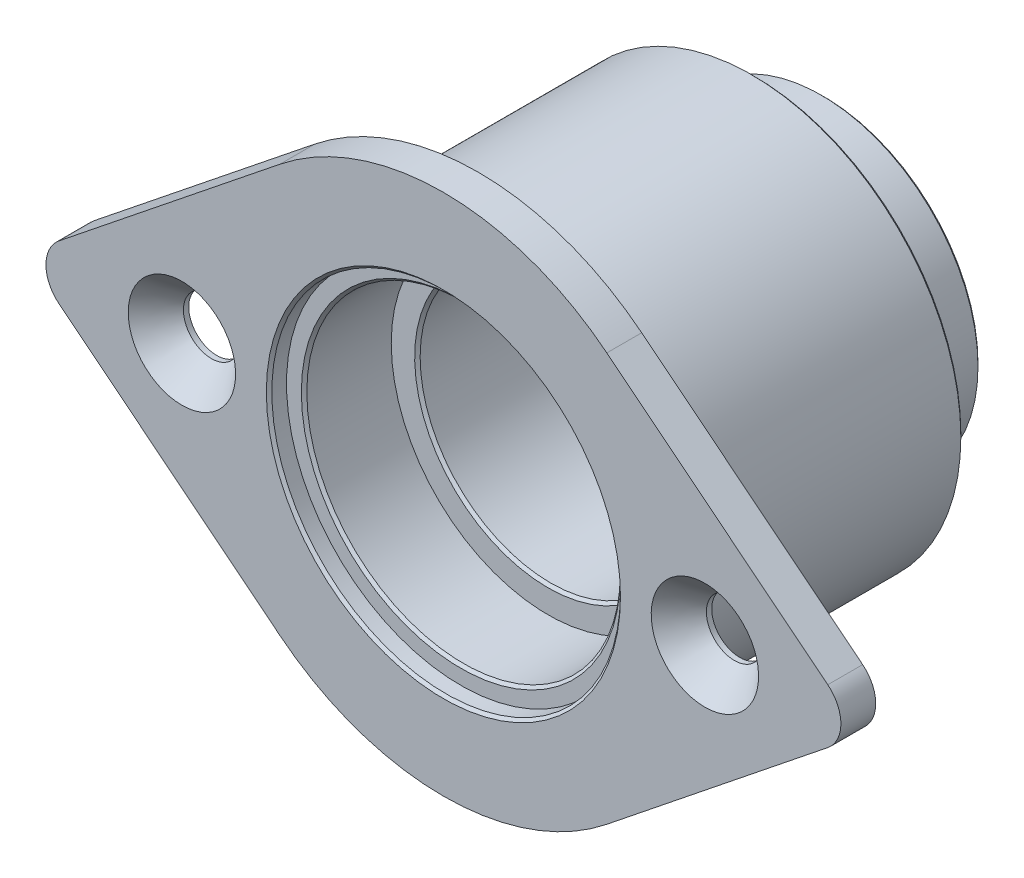
ISO-10303-21;
HEADER;
FILE_DESCRIPTION(('STEP AP214'),'2;1');
FILE_NAME('part.step','',(''),(''),'','','');
FILE_SCHEMA(('AUTOMOTIVE_DESIGN { 1 0 10303 214 1 1 1 1 }'));
ENDSEC;
DATA;
#1=APPLICATION_CONTEXT('core data for automotive mechanical design processes');
#2=APPLICATION_PROTOCOL_DEFINITION('international standard','automotive_design',2000,#1);
#3=PRODUCT_CONTEXT('',#1,'mechanical');
#4=PRODUCT('Part','Part','',(#3));
#5=PRODUCT_RELATED_PRODUCT_CATEGORY('part','',(#4));
#6=PRODUCT_DEFINITION_FORMATION('','',#4);
#7=PRODUCT_DEFINITION_CONTEXT('part definition',#1,'design');
#8=PRODUCT_DEFINITION('design','',#6,#7);
#9=PRODUCT_DEFINITION_SHAPE('','',#8);
#10=(LENGTH_UNIT() NAMED_UNIT(*) SI_UNIT(.MILLI.,.METRE.));
#11=(NAMED_UNIT(*) PLANE_ANGLE_UNIT() SI_UNIT($,.RADIAN.));
#12=(NAMED_UNIT(*) SI_UNIT($,.STERADIAN.) SOLID_ANGLE_UNIT());
#13=UNCERTAINTY_MEASURE_WITH_UNIT(LENGTH_MEASURE(1.E-05),#10,'distance_accuracy_value','');
#14=(GEOMETRIC_REPRESENTATION_CONTEXT(3) GLOBAL_UNCERTAINTY_ASSIGNED_CONTEXT((#13)) GLOBAL_UNIT_ASSIGNED_CONTEXT((#10,
#11,#12)) REPRESENTATION_CONTEXT('',''));
#15=CARTESIAN_POINT('',(0.,0.,0.));
#16=DIRECTION('',(0.,0.,1.));
#17=DIRECTION('',(1.,0.,0.));
#18=AXIS2_PLACEMENT_3D('',#15,#16,#17);
#19=CARTESIAN_POINT('',(0.,0.,-7.9375));
#20=DIRECTION('',(0.,0.,1.));
#21=DIRECTION('',(1.,0.,0.));
#22=AXIS2_PLACEMENT_3D('',#19,#20,#21);
#23=PLANE('',#22);
#24=CARTESIAN_POINT('',(0.,0.,-7.9375));
#25=DIRECTION('',(0.,0.,-1.));
#26=DIRECTION('',(-1.,0.,0.));
#27=AXIS2_PLACEMENT_3D('',#24,#25,#26);
#28=CIRCLE('',#27,14.2748);
#29=CARTESIAN_POINT('',(-14.2748,0.,-7.9375));
#30=VERTEX_POINT('',#29);
#31=EDGE_CURVE('E136',#30,#30,#28,.F.);
#32=ORIENTED_EDGE('',*,*,#31,.T.);
#33=EDGE_LOOP('',(#32));
#34=FACE_BOUND('',#33,.T.);
#35=CARTESIAN_POINT('',(0.,0.,-7.9375));
#36=DIRECTION('',(0.,0.,1.));
#37=DIRECTION('',(0.,-1.,0.));
#38=AXIS2_PLACEMENT_3D('',#35,#36,#37);
#39=CIRCLE('',#38,12.1435499999999);
#40=CARTESIAN_POINT('',(0.,-12.1435499999999,-7.9375));
#41=VERTEX_POINT('',#40);
#42=EDGE_CURVE('E20',#41,#41,#39,.F.);
#43=ORIENTED_EDGE('',*,*,#42,.T.);
#44=EDGE_LOOP('',(#43));
#45=FACE_BOUND('',#44,.T.);
#46=ADVANCED_FACE('F17',(#34,#45),#23,.T.);
#47=CARTESIAN_POINT('',(0.,0.,-7.9375));
#48=DIRECTION('',(0.,0.,1.));
#49=DIRECTION('',(0.,-1.,0.));
#50=AXIS2_PLACEMENT_3D('',#47,#48,#49);
#51=CONICAL_SURFACE('',#50,12.1435499999999,0.785398163397434);
#52=CARTESIAN_POINT('',(0.,0.,-8.18749999999995));
#53=DIRECTION('',(0.,0.,-1.));
#54=DIRECTION('',(-1.,0.,0.));
#55=AXIS2_PLACEMENT_3D('',#52,#53,#54);
#56=CIRCLE('',#55,11.89355);
#57=CARTESIAN_POINT('',(-11.89355,0.,-8.18749999999995));
#58=VERTEX_POINT('',#57);
#59=EDGE_CURVE('E134',#58,#58,#56,.T.);
#60=ORIENTED_EDGE('',*,*,#59,.T.);
#61=EDGE_LOOP('',(#60));
#62=FACE_BOUND('',#61,.T.);
#63=ORIENTED_EDGE('',*,*,#42,.F.);
#64=EDGE_LOOP('',(#63));
#65=FACE_BOUND('',#64,.T.);
#66=ADVANCED_FACE('F195',(#62,#65),#51,.F.);
#67=CARTESIAN_POINT('',(0.,0.,1.5875));
#68=DIRECTION('',(0.,0.,-1.));
#69=DIRECTION('',(-1.,0.,0.));
#70=AXIS2_PLACEMENT_3D('',#67,#68,#69);
#71=CYLINDRICAL_SURFACE('',#70,14.2748);
#72=CARTESIAN_POINT('',(0.,0.,-0.249999999999985));
#73=DIRECTION('',(0.,0.,1.));
#74=DIRECTION('',(1.,0.,0.));
#75=AXIS2_PLACEMENT_3D('',#72,#73,#74);
#76=CIRCLE('',#75,14.2748);
#77=CARTESIAN_POINT('',(14.2748,0.,-0.249999999999985));
#78=VERTEX_POINT('',#77);
#79=EDGE_CURVE('E131',#78,#78,#76,.T.);
#80=ORIENTED_EDGE('',*,*,#79,.T.);
#81=EDGE_LOOP('',(#80));
#82=FACE_BOUND('',#81,.T.);
#83=ORIENTED_EDGE('',*,*,#31,.F.);
#84=EDGE_LOOP('',(#83));
#85=FACE_BOUND('',#84,.T.);
#86=ADVANCED_FACE('F197',(#82,#85),#71,.F.);
#87=CARTESIAN_POINT('',(0.,0.,38.7877315203269));
#88=DIRECTION('',(0.,0.,-1.));
#89=DIRECTION('',(-1.,0.,0.));
#90=AXIS2_PLACEMENT_3D('',#87,#88,#89);
#91=CYLINDRICAL_SURFACE('',#90,11.89355);
#92=ORIENTED_EDGE('',*,*,#59,.F.);
#93=EDGE_LOOP('',(#92));
#94=FACE_BOUND('',#93,.T.);
#95=CARTESIAN_POINT('',(0.,0.,-32.8334999999999));
#96=DIRECTION('',(0.,0.,-1.));
#97=DIRECTION('',(-1.,0.,0.));
#98=AXIS2_PLACEMENT_3D('',#95,#96,#97);
#99=CIRCLE('',#98,11.89355);
#100=CARTESIAN_POINT('',(-11.89355,0.,-32.8334999999999));
#101=VERTEX_POINT('',#100);
#102=EDGE_CURVE('E127',#101,#101,#99,.T.);
#103=ORIENTED_EDGE('',*,*,#102,.T.);
#104=EDGE_LOOP('',(#103));
#105=FACE_BOUND('',#104,.T.);
#106=ADVANCED_FACE('F204',(#94,#105),#91,.F.);
#107=CARTESIAN_POINT('',(0.,0.,0.));
#108=DIRECTION('',(0.,0.,1.));
#109=DIRECTION('',(1.,0.,0.));
#110=AXIS2_PLACEMENT_3D('',#107,#108,#109);
#111=CONICAL_SURFACE('',#110,14.5248,0.785398163397459);
#112=ORIENTED_EDGE('',*,*,#79,.F.);
#113=EDGE_LOOP('',(#112));
#114=FACE_BOUND('',#113,.T.);
#115=CARTESIAN_POINT('',(0.,0.,0.));
#116=DIRECTION('',(0.,0.,1.));
#117=DIRECTION('',(1.,0.,0.));
#118=AXIS2_PLACEMENT_3D('',#115,#116,#117);
#119=CIRCLE('',#118,14.5248);
#120=CARTESIAN_POINT('',(14.5248,0.,0.));
#121=VERTEX_POINT('',#120);
#122=EDGE_CURVE('E130',#121,#121,#119,.F.);
#123=ORIENTED_EDGE('',*,*,#122,.F.);
#124=EDGE_LOOP('',(#123));
#125=FACE_BOUND('',#124,.T.);
#126=ADVANCED_FACE('F300',(#114,#125),#111,.F.);
#127=CARTESIAN_POINT('',(0.,0.,-33.0835));
#128=DIRECTION('',(0.,0.,-1.));
#129=DIRECTION('',(0.,1.,0.));
#130=AXIS2_PLACEMENT_3D('',#127,#128,#129);
#131=CONICAL_SURFACE('',#130,12.1435500000001,0.785398163397448);
#132=ORIENTED_EDGE('',*,*,#102,.F.);
#133=EDGE_LOOP('',(#132));
#134=FACE_BOUND('',#133,.T.);
#135=CARTESIAN_POINT('',(0.,0.,-33.0835));
#136=DIRECTION('',(0.,0.,-1.));
#137=DIRECTION('',(0.,1.,0.));
#138=AXIS2_PLACEMENT_3D('',#135,#136,#137);
#139=CIRCLE('',#138,12.1435500000001);
#140=CARTESIAN_POINT('',(0.,12.1435500000001,-33.0835));
#141=VERTEX_POINT('',#140);
#142=EDGE_CURVE('E184',#141,#141,#139,.F.);
#143=ORIENTED_EDGE('',*,*,#142,.F.);
#144=EDGE_LOOP('',(#143));
#145=FACE_BOUND('',#144,.T.);
#146=ADVANCED_FACE('F296',(#134,#145),#131,.F.);
#147=CARTESIAN_POINT('',(0.,0.,0.));
#148=DIRECTION('',(0.,0.,1.));
#149=DIRECTION('',(1.,0.,0.));
#150=AXIS2_PLACEMENT_3D('',#147,#148,#149);
#151=PLANE('',#150);
#152=CARTESIAN_POINT('',(0.,0.,0.));
#153=DIRECTION('',(0.,0.,1.));
#154=DIRECTION('',(1.,0.,0.));
#155=AXIS2_PLACEMENT_3D('',#152,#153,#154);
#156=CIRCLE('',#155,15.875);
#157=CARTESIAN_POINT('',(15.875,0.,0.));
#158=VERTEX_POINT('',#157);
#159=EDGE_CURVE('E181',#158,#158,#156,.T.);
#160=ORIENTED_EDGE('',*,*,#159,.T.);
#161=EDGE_LOOP('',(#160));
#162=FACE_BOUND('',#161,.T.);
#163=ORIENTED_EDGE('',*,*,#122,.T.);
#164=EDGE_LOOP('',(#163));
#165=FACE_BOUND('',#164,.T.);
#166=ADVANCED_FACE('F292',(#162,#165),#151,.T.);
#167=CARTESIAN_POINT('',(0.,0.,-33.0835));
#168=DIRECTION('',(0.,0.,-1.));
#169=DIRECTION('',(-1.,0.,0.));
#170=AXIS2_PLACEMENT_3D('',#167,#168,#169);
#171=PLANE('',#170);
#172=ORIENTED_EDGE('',*,*,#142,.T.);
#173=EDGE_LOOP('',(#172));
#174=FACE_BOUND('',#173,.T.);
#175=CARTESIAN_POINT('',(0.,0.,-33.0835));
#176=DIRECTION('',(0.,0.,1.));
#177=DIRECTION('',(1.,0.,0.));
#178=AXIS2_PLACEMENT_3D('',#175,#176,#177);
#179=CIRCLE('',#178,14.0121);
#180=CARTESIAN_POINT('',(14.0121,0.,-33.0835));
#181=VERTEX_POINT('',#180);
#182=EDGE_CURVE('E126',#181,#181,#179,.T.);
#183=ORIENTED_EDGE('',*,*,#182,.F.);
#184=EDGE_LOOP('',(#183));
#185=FACE_BOUND('',#184,.T.);
#186=ADVANCED_FACE('F288',(#174,#185),#171,.T.);
#187=CARTESIAN_POINT('',(0.,0.,0.));
#188=DIRECTION('',(0.,0.,1.));
#189=DIRECTION('',(1.,0.,0.));
#190=AXIS2_PLACEMENT_3D('',#187,#188,#189);
#191=CYLINDRICAL_SURFACE('',#190,15.875);
#192=ORIENTED_EDGE('',*,*,#159,.F.);
#193=EDGE_LOOP('',(#192));
#194=FACE_BOUND('',#193,.T.);
#195=CARTESIAN_POINT('',(0.,0.,1.3375));
#196=DIRECTION('',(0.,0.,1.));
#197=DIRECTION('',(1.,0.,0.));
#198=AXIS2_PLACEMENT_3D('',#195,#196,#197);
#199=CIRCLE('',#198,15.875);
#200=CARTESIAN_POINT('',(15.875,0.,1.3375));
#201=VERTEX_POINT('',#200);
#202=EDGE_CURVE('E123',#201,#201,#199,.T.);
#203=ORIENTED_EDGE('',*,*,#202,.T.);
#204=EDGE_LOOP('',(#203));
#205=FACE_BOUND('',#204,.T.);
#206=ADVANCED_FACE('F284',(#194,#205),#191,.F.);
#207=CARTESIAN_POINT('',(0.,0.,-32.8335));
#208=DIRECTION('',(0.,0.,1.));
#209=DIRECTION('',(1.,0.,0.));
#210=AXIS2_PLACEMENT_3D('',#207,#208,#209);
#211=CONICAL_SURFACE('',#210,14.2621,0.785398163397424);
#212=CARTESIAN_POINT('',(0.,0.,-32.8335));
#213=DIRECTION('',(0.,0.,-1.));
#214=DIRECTION('',(-1.,0.,0.));
#215=AXIS2_PLACEMENT_3D('',#212,#213,#214);
#216=CIRCLE('',#215,14.2621);
#217=CARTESIAN_POINT('',(-14.2621,0.,-32.8335));
#218=VERTEX_POINT('',#217);
#219=EDGE_CURVE('E119',#218,#218,#216,.F.);
#220=ORIENTED_EDGE('',*,*,#219,.F.);
#221=EDGE_LOOP('',(#220));
#222=FACE_BOUND('',#221,.T.);
#223=ORIENTED_EDGE('',*,*,#182,.T.);
#224=EDGE_LOOP('',(#223));
#225=FACE_BOUND('',#224,.T.);
#226=ADVANCED_FACE('F280',(#222,#225),#211,.T.);
#227=CARTESIAN_POINT('',(0.,0.,1.5875));
#228=DIRECTION('',(0.,0.,1.));
#229=DIRECTION('',(1.,0.,0.));
#230=AXIS2_PLACEMENT_3D('',#227,#228,#229);
#231=CONICAL_SURFACE('',#230,16.125,0.785398163397476);
#232=ORIENTED_EDGE('',*,*,#202,.F.);
#233=EDGE_LOOP('',(#232));
#234=FACE_BOUND('',#233,.T.);
#235=CARTESIAN_POINT('',(0.,0.,1.5875));
#236=DIRECTION('',(0.,0.,1.));
#237=DIRECTION('',(1.,0.,0.));
#238=AXIS2_PLACEMENT_3D('',#235,#236,#237);
#239=CIRCLE('',#238,16.125);
#240=CARTESIAN_POINT('',(16.125,0.,1.5875));
#241=VERTEX_POINT('',#240);
#242=EDGE_CURVE('E122',#241,#241,#239,.F.);
#243=ORIENTED_EDGE('',*,*,#242,.F.);
#244=EDGE_LOOP('',(#243));
#245=FACE_BOUND('',#244,.T.);
#246=ADVANCED_FACE('F276',(#234,#245),#231,.F.);
#247=CARTESIAN_POINT('',(0.,0.,27.1480367264149));
#248=DIRECTION('',(0.,0.,-1.));
#249=DIRECTION('',(-1.,0.,0.));
#250=AXIS2_PLACEMENT_3D('',#247,#248,#249);
#251=CYLINDRICAL_SURFACE('',#250,14.2621);
#252=ORIENTED_EDGE('',*,*,#219,.T.);
#253=EDGE_LOOP('',(#252));
#254=FACE_BOUND('',#253,.T.);
#255=CARTESIAN_POINT('',(0.,0.,-26.7335));
#256=DIRECTION('',(0.,0.,-1.));
#257=DIRECTION('',(-1.,0.,0.));
#258=AXIS2_PLACEMENT_3D('',#255,#256,#257);
#259=CIRCLE('',#258,14.2621);
#260=CARTESIAN_POINT('',(-14.2621,0.,-26.7335));
#261=VERTEX_POINT('',#260);
#262=EDGE_CURVE('E118',#261,#261,#259,.F.);
#263=ORIENTED_EDGE('',*,*,#262,.F.);
#264=EDGE_LOOP('',(#263));
#265=FACE_BOUND('',#264,.T.);
#266=ADVANCED_FACE('F272',(#254,#265),#251,.T.);
#267=CARTESIAN_POINT('',(-23.8125,0.,1.58749999997099));
#268=DIRECTION('',(0.,0.,1.));
#269=DIRECTION('',(0.,-1.,0.));
#270=AXIS2_PLACEMENT_3D('',#267,#268,#269);
#271=CONICAL_SURFACE('',#270,4.88949999997067,0.71558499333661);
#272=CARTESIAN_POINT('',(-23.8125,0.,-1.10068089399406));
#273=DIRECTION('',(0.,0.,1.));
#274=DIRECTION('',(1.,0.,0.));
#275=AXIS2_PLACEMENT_3D('',#272,#273,#274);
#276=CIRCLE('',#275,2.5527);
#277=CARTESIAN_POINT('',(-21.2598,0.,-1.10068089399406));
#278=VERTEX_POINT('',#277);
#279=EDGE_CURVE('E115',#278,#278,#276,.F.);
#280=ORIENTED_EDGE('',*,*,#279,.T.);
#281=EDGE_LOOP('',(#280));
#282=FACE_BOUND('',#281,.T.);
#283=CARTESIAN_POINT('',(-23.8125,0.,1.58749999997099));
#284=DIRECTION('',(0.,0.,1.));
#285=DIRECTION('',(0.,-1.,0.));
#286=AXIS2_PLACEMENT_3D('',#283,#284,#285);
#287=CIRCLE('',#286,4.88949999997067);
#288=CARTESIAN_POINT('',(-23.8125,-4.88949999997067,1.58749999997099));
#289=VERTEX_POINT('',#288);
#290=EDGE_CURVE('E174',#289,#289,#287,.F.);
#291=ORIENTED_EDGE('',*,*,#290,.F.);
#292=EDGE_LOOP('',(#291));
#293=FACE_BOUND('',#292,.T.);
#294=ADVANCED_FACE('F268',(#282,#293),#271,.F.);
#295=CARTESIAN_POINT('',(23.8125,0.,1.58749999997099));
#296=DIRECTION('',(0.,0.,1.));
#297=DIRECTION('',(0.,-1.,0.));
#298=AXIS2_PLACEMENT_3D('',#295,#296,#297);
#299=CONICAL_SURFACE('',#298,4.88949999995293,0.71558499333661);
#300=CARTESIAN_POINT('',(23.8125,0.,-1.10068089399406));
#301=DIRECTION('',(0.,0.,1.));
#302=DIRECTION('',(1.,0.,0.));
#303=AXIS2_PLACEMENT_3D('',#300,#301,#302);
#304=CIRCLE('',#303,2.5527);
#305=CARTESIAN_POINT('',(26.3652,0.,-1.10068089399406));
#306=VERTEX_POINT('',#305);
#307=EDGE_CURVE('E93',#306,#306,#304,.F.);
#308=ORIENTED_EDGE('',*,*,#307,.T.);
#309=EDGE_LOOP('',(#308));
#310=FACE_BOUND('',#309,.T.);
#311=CARTESIAN_POINT('',(23.8125,0.,1.58749999997099));
#312=DIRECTION('',(0.,0.,1.));
#313=DIRECTION('',(0.,-1.,0.));
#314=AXIS2_PLACEMENT_3D('',#311,#312,#313);
#315=CIRCLE('',#314,4.88949999995293);
#316=CARTESIAN_POINT('',(23.8125,-4.88949999995292,1.58749999997099));
#317=VERTEX_POINT('',#316);
#318=EDGE_CURVE('E171',#317,#317,#315,.F.);
#319=ORIENTED_EDGE('',*,*,#318,.F.);
#320=EDGE_LOOP('',(#319));
#321=FACE_BOUND('',#320,.T.);
#322=ADVANCED_FACE('F265',(#310,#321),#299,.F.);
#323=CARTESIAN_POINT('',(0.,0.,1.5875));
#324=DIRECTION('',(0.,0.,1.));
#325=DIRECTION('',(1.,0.,0.));
#326=AXIS2_PLACEMENT_3D('',#323,#324,#325);
#327=PLANE('',#326);
#328=DIRECTION('',(-0.7806247497998,0.625,0.));
#329=VECTOR('',#328,1.);
#330=CARTESIAN_POINT('',(-14.8828125,-18.5886268546077,1.5875));
#331=LINE('',#330,#329);
#332=CARTESIAN_POINT('',(-35.004375,-2.47848358061436,1.5875));
#333=VERTEX_POINT('',#332);
#334=CARTESIAN_POINT('',(-14.8828125,-18.5886268546077,1.5875));
#335=VERTEX_POINT('',#334);
#336=EDGE_CURVE('E111',#333,#335,#331,.F.);
#337=ORIENTED_EDGE('',*,*,#336,.T.);
#338=CARTESIAN_POINT('',(0.,0.,1.5875));
#339=DIRECTION('',(0.,0.,-1.));
#340=DIRECTION('',(-1.,0.,0.));
#341=AXIS2_PLACEMENT_3D('',#338,#339,#340);
#342=CIRCLE('',#341,23.8125);
#343=CARTESIAN_POINT('',(14.8828125,-18.5886268546077,1.5875));
#344=VERTEX_POINT('',#343);
#345=EDGE_CURVE('E163',#344,#335,#342,.T.);
#346=ORIENTED_EDGE('',*,*,#345,.F.);
#347=DIRECTION('',(0.7806247497998,0.625,0.));
#348=VECTOR('',#347,1.);
#349=CARTESIAN_POINT('',(14.8828125,-18.5886268546077,1.5875));
#350=LINE('',#349,#348);
#351=CARTESIAN_POINT('',(35.004375,-2.47848358061437,1.5875));
#352=VERTEX_POINT('',#351);
#353=EDGE_CURVE('E522',#352,#344,#350,.F.);
#354=ORIENTED_EDGE('',*,*,#353,.F.);
#355=CARTESIAN_POINT('',(33.02,0.,1.5875));
#356=DIRECTION('',(0.,0.,-1.));
#357=DIRECTION('',(-1.,0.,0.));
#358=AXIS2_PLACEMENT_3D('',#355,#356,#357);
#359=CIRCLE('',#358,3.175);
#360=CARTESIAN_POINT('',(35.004375,2.47848358061436,1.5875));
#361=VERTEX_POINT('',#360);
#362=EDGE_CURVE('E158',#361,#352,#359,.T.);
#363=ORIENTED_EDGE('',*,*,#362,.F.);
#364=DIRECTION('',(-0.7806247497998,0.625,0.));
#365=VECTOR('',#364,1.);
#366=CARTESIAN_POINT('',(14.8828125,18.5886268546077,1.5875));
#367=LINE('',#366,#365);
#368=CARTESIAN_POINT('',(14.8828125,18.5886268546077,1.5875));
#369=VERTEX_POINT('',#368);
#370=EDGE_CURVE('E89',#369,#361,#367,.F.);
#371=ORIENTED_EDGE('',*,*,#370,.F.);
#372=CARTESIAN_POINT('',(0.,0.,1.5875));
#373=DIRECTION('',(0.,0.,-1.));
#374=DIRECTION('',(-1.,0.,0.));
#375=AXIS2_PLACEMENT_3D('',#372,#373,#374);
#376=CIRCLE('',#375,23.8125);
#377=CARTESIAN_POINT('',(-14.8828125,18.5886268546077,1.5875));
#378=VERTEX_POINT('',#377);
#379=EDGE_CURVE('E81',#378,#369,#376,.T.);
#380=ORIENTED_EDGE('',*,*,#379,.F.);
#381=DIRECTION('',(0.7806247497998,0.625,0.));
#382=VECTOR('',#381,1.);
#383=CARTESIAN_POINT('',(-14.8828125,18.5886268546077,1.5875));
#384=LINE('',#383,#382);
#385=CARTESIAN_POINT('',(-35.004375,2.47848358061436,1.5875));
#386=VERTEX_POINT('',#385);
#387=EDGE_CURVE('E86',#378,#386,#384,.F.);
#388=ORIENTED_EDGE('',*,*,#387,.T.);
#389=CARTESIAN_POINT('',(-33.02,0.,1.5875));
#390=DIRECTION('',(0.,0.,-1.));
#391=DIRECTION('',(-1.,0.,0.));
#392=AXIS2_PLACEMENT_3D('',#389,#390,#391);
#393=CIRCLE('',#392,3.175);
#394=EDGE_CURVE('E107',#333,#386,#393,.T.);
#395=ORIENTED_EDGE('',*,*,#394,.F.);
#396=EDGE_LOOP('',(#337,#346,#354,#363,#371,#380,#388,#395));
#397=FACE_BOUND('',#396,.T.);
#398=ORIENTED_EDGE('',*,*,#318,.T.);
#399=EDGE_LOOP('',(#398));
#400=FACE_BOUND('',#399,.T.);
#401=ORIENTED_EDGE('',*,*,#290,.T.);
#402=EDGE_LOOP('',(#401));
#403=FACE_BOUND('',#402,.T.);
#404=ORIENTED_EDGE('',*,*,#242,.T.);
#405=EDGE_LOOP('',(#404));
#406=FACE_BOUND('',#405,.T.);
#407=ADVANCED_FACE('F83',(#397,#400,#403,#406),#327,.T.);
#408=CARTESIAN_POINT('',(0.,0.,-26.7335));
#409=DIRECTION('',(0.,0.,-1.));
#410=DIRECTION('',(-1.,0.,0.));
#411=AXIS2_PLACEMENT_3D('',#408,#409,#410);
#412=PLANE('',#411);
#413=ORIENTED_EDGE('',*,*,#262,.T.);
#414=EDGE_LOOP('',(#413));
#415=FACE_BOUND('',#414,.T.);
#416=CARTESIAN_POINT('',(0.,0.,-26.7335));
#417=DIRECTION('',(0.,0.,1.));
#418=DIRECTION('',(1.,0.,0.));
#419=AXIS2_PLACEMENT_3D('',#416,#417,#418);
#420=CIRCLE('',#419,18.8);
#421=CARTESIAN_POINT('',(18.8,0.,-26.7335));
#422=VERTEX_POINT('',#421);
#423=EDGE_CURVE('E154',#422,#422,#420,.T.);
#424=ORIENTED_EDGE('',*,*,#423,.F.);
#425=EDGE_LOOP('',(#424));
#426=FACE_BOUND('',#425,.T.);
#427=ADVANCED_FACE('F258',(#415,#426),#412,.T.);
#428=CARTESIAN_POINT('',(-23.8125,0.,1.5875));
#429=DIRECTION('',(0.,0.,1.));
#430=DIRECTION('',(1.,0.,0.));
#431=AXIS2_PLACEMENT_3D('',#428,#429,#430);
#432=CYLINDRICAL_SURFACE('',#431,2.5527);
#433=CARTESIAN_POINT('',(-23.8125,0.,-1.5875));
#434=DIRECTION('',(0.,0.,1.));
#435=DIRECTION('',(1.,0.,0.));
#436=AXIS2_PLACEMENT_3D('',#433,#434,#435);
#437=CIRCLE('',#436,2.5527);
#438=CARTESIAN_POINT('',(-21.2598,0.,-1.5875));
#439=VERTEX_POINT('',#438);
#440=EDGE_CURVE('E151',#439,#439,#437,.F.);
#441=ORIENTED_EDGE('',*,*,#440,.T.);
#442=EDGE_LOOP('',(#441));
#443=FACE_BOUND('',#442,.T.);
#444=ORIENTED_EDGE('',*,*,#279,.F.);
#445=EDGE_LOOP('',(#444));
#446=FACE_BOUND('',#445,.T.);
#447=ADVANCED_FACE('F254',(#443,#446),#432,.F.);
#448=CARTESIAN_POINT('',(23.8125,0.,1.5875));
#449=DIRECTION('',(0.,0.,1.));
#450=DIRECTION('',(1.,0.,0.));
#451=AXIS2_PLACEMENT_3D('',#448,#449,#450);
#452=CYLINDRICAL_SURFACE('',#451,2.5527);
#453=CARTESIAN_POINT('',(23.8125,0.,-1.5875));
#454=DIRECTION('',(0.,0.,1.));
#455=DIRECTION('',(1.,0.,0.));
#456=AXIS2_PLACEMENT_3D('',#453,#454,#455);
#457=CIRCLE('',#456,2.5527);
#458=CARTESIAN_POINT('',(26.3652,0.,-1.5875));
#459=VERTEX_POINT('',#458);
#460=EDGE_CURVE('E148',#459,#459,#457,.F.);
#461=ORIENTED_EDGE('',*,*,#460,.T.);
#462=EDGE_LOOP('',(#461));
#463=FACE_BOUND('',#462,.T.);
#464=ORIENTED_EDGE('',*,*,#307,.F.);
#465=EDGE_LOOP('',(#464));
#466=FACE_BOUND('',#465,.T.);
#467=ADVANCED_FACE('F251',(#463,#466),#452,.F.);
#468=CARTESIAN_POINT('',(0.,0.,1.5875));
#469=DIRECTION('',(0.,0.,-1.));
#470=DIRECTION('',(-1.,0.,0.));
#471=AXIS2_PLACEMENT_3D('',#468,#469,#470);
#472=CYLINDRICAL_SURFACE('',#471,23.8125);
#473=ORIENTED_EDGE('',*,*,#379,.T.);
#474=DIRECTION('',(0.,0.,1.));
#475=VECTOR('',#474,1.);
#476=CARTESIAN_POINT('',(14.8828125,18.5886268546077,1.5875));
#477=LINE('',#476,#475);
#478=CARTESIAN_POINT('',(14.8828125,18.5886268546077,-1.5875));
#479=VERTEX_POINT('',#478);
#480=EDGE_CURVE('E157',#479,#369,#477,.T.);
#481=ORIENTED_EDGE('',*,*,#480,.F.);
#482=CARTESIAN_POINT('',(0.,0.,-1.5875));
#483=DIRECTION('',(0.,0.,-1.));
#484=DIRECTION('',(-1.,0.,0.));
#485=AXIS2_PLACEMENT_3D('',#482,#483,#484);
#486=CIRCLE('',#485,23.8125);
#487=CARTESIAN_POINT('',(-14.8828125,18.5886268546077,-1.5875));
#488=VERTEX_POINT('',#487);
#489=EDGE_CURVE('E98',#479,#488,#486,.F.);
#490=ORIENTED_EDGE('',*,*,#489,.T.);
#491=DIRECTION('',(0.,0.,1.));
#492=VECTOR('',#491,1.);
#493=CARTESIAN_POINT('',(-14.8828125,18.5886268546077,1.5875));
#494=LINE('',#493,#492);
#495=EDGE_CURVE('E92',#488,#378,#494,.T.);
#496=ORIENTED_EDGE('',*,*,#495,.T.);
#497=EDGE_LOOP('',(#473,#481,#490,#496));
#498=FACE_BOUND('',#497,.T.);
#499=ADVANCED_FACE('F96',(#498),#472,.T.);
#500=CARTESIAN_POINT('',(-14.8828125,18.5886268546077,1.5875));
#501=DIRECTION('',(0.625,-0.7806247497998,0.));
#502=DIRECTION('',(0.7806247497998,0.625,0.));
#503=AXIS2_PLACEMENT_3D('',#500,#501,#502);
#504=PLANE('',#503);
#505=DIRECTION('',(0.,0.,-1.));
#506=VECTOR('',#505,1.);
#507=CARTESIAN_POINT('',(-35.004375,2.47848358061435,1.5875));
#508=LINE('',#507,#506);
#509=CARTESIAN_POINT('',(-35.004375,2.47848358061436,-1.5875));
#510=VERTEX_POINT('',#509);
#511=EDGE_CURVE('E105',#386,#510,#508,.T.);
#512=ORIENTED_EDGE('',*,*,#511,.F.);
#513=ORIENTED_EDGE('',*,*,#387,.F.);
#514=ORIENTED_EDGE('',*,*,#495,.F.);
#515=DIRECTION('',(-0.7806247497998,-0.625,0.));
#516=VECTOR('',#515,1.);
#517=CARTESIAN_POINT('',(-14.8828125,18.5886268546077,-1.5875));
#518=LINE('',#517,#516);
#519=EDGE_CURVE('E146',#488,#510,#518,.T.);
#520=ORIENTED_EDGE('',*,*,#519,.T.);
#521=EDGE_LOOP('',(#512,#513,#514,#520));
#522=FACE_BOUND('',#521,.T.);
#523=ADVANCED_FACE('F103',(#522),#504,.F.);
#524=CARTESIAN_POINT('',(-33.02,0.,1.5875));
#525=DIRECTION('',(0.,0.,-1.));
#526=DIRECTION('',(-1.,0.,0.));
#527=AXIS2_PLACEMENT_3D('',#524,#525,#526);
#528=CYLINDRICAL_SURFACE('',#527,3.175);
#529=CARTESIAN_POINT('',(-33.02,0.,-1.5875));
#530=DIRECTION('',(0.,0.,-1.));
#531=DIRECTION('',(-1.,0.,0.));
#532=AXIS2_PLACEMENT_3D('',#529,#530,#531);
#533=CIRCLE('',#532,3.175);
#534=CARTESIAN_POINT('',(-35.004375,-2.47848358061437,-1.5875));
#535=VERTEX_POINT('',#534);
#536=EDGE_CURVE('E144',#510,#535,#533,.F.);
#537=ORIENTED_EDGE('',*,*,#536,.T.);
#538=DIRECTION('',(0.,0.,1.));
#539=VECTOR('',#538,1.);
#540=CARTESIAN_POINT('',(-35.004375,-2.47848358061437,1.5875));
#541=LINE('',#540,#539);
#542=EDGE_CURVE('E167',#535,#333,#541,.T.);
#543=ORIENTED_EDGE('',*,*,#542,.T.);
#544=ORIENTED_EDGE('',*,*,#394,.T.);
#545=ORIENTED_EDGE('',*,*,#511,.T.);
#546=EDGE_LOOP('',(#537,#543,#544,#545));
#547=FACE_BOUND('',#546,.T.);
#548=ADVANCED_FACE('F242',(#547),#528,.T.);
#549=CARTESIAN_POINT('',(-14.8828125,-18.5886268546077,1.5875));
#550=DIRECTION('',(0.625,0.7806247497998,0.));
#551=DIRECTION('',(-0.7806247497998,0.625,0.));
#552=AXIS2_PLACEMENT_3D('',#549,#550,#551);
#553=PLANE('',#552);
#554=ORIENTED_EDGE('',*,*,#542,.F.);
#555=DIRECTION('',(0.7806247497998,-0.625,0.));
#556=VECTOR('',#555,1.);
#557=CARTESIAN_POINT('',(-35.004375,-2.47848358061437,-1.5875));
#558=LINE('',#557,#556);
#559=CARTESIAN_POINT('',(-14.8828125,-18.5886268546077,-1.5875));
#560=VERTEX_POINT('',#559);
#561=EDGE_CURVE('E143',#535,#560,#558,.T.);
#562=ORIENTED_EDGE('',*,*,#561,.T.);
#563=DIRECTION('',(0.,0.,-1.));
#564=VECTOR('',#563,1.);
#565=CARTESIAN_POINT('',(-14.8828125,-18.5886268546077,1.5875));
#566=LINE('',#565,#564);
#567=EDGE_CURVE('E166',#335,#560,#566,.T.);
#568=ORIENTED_EDGE('',*,*,#567,.F.);
#569=ORIENTED_EDGE('',*,*,#336,.F.);
#570=EDGE_LOOP('',(#554,#562,#568,#569));
#571=FACE_BOUND('',#570,.T.);
#572=ADVANCED_FACE('F238',(#571),#553,.F.);
#573=CARTESIAN_POINT('',(0.,0.,1.5875));
#574=DIRECTION('',(0.,0.,-1.));
#575=DIRECTION('',(-1.,0.,0.));
#576=AXIS2_PLACEMENT_3D('',#573,#574,#575);
#577=CYLINDRICAL_SURFACE('',#576,23.8125);
#578=ORIENTED_EDGE('',*,*,#345,.T.);
#579=ORIENTED_EDGE('',*,*,#567,.T.);
#580=CARTESIAN_POINT('',(0.,0.,-1.5875));
#581=DIRECTION('',(0.,0.,-1.));
#582=DIRECTION('',(-1.,0.,0.));
#583=AXIS2_PLACEMENT_3D('',#580,#581,#582);
#584=CIRCLE('',#583,23.8125);
#585=CARTESIAN_POINT('',(14.8828125,-18.5886268546077,-1.5875));
#586=VERTEX_POINT('',#585);
#587=EDGE_CURVE('E141',#560,#586,#584,.F.);
#588=ORIENTED_EDGE('',*,*,#587,.T.);
#589=DIRECTION('',(0.,0.,1.));
#590=VECTOR('',#589,1.);
#591=CARTESIAN_POINT('',(14.8828125,-18.5886268546077,1.5875));
#592=LINE('',#591,#590);
#593=EDGE_CURVE('E162',#344,#586,#592,.F.);
#594=ORIENTED_EDGE('',*,*,#593,.F.);
#595=EDGE_LOOP('',(#578,#579,#588,#594));
#596=FACE_BOUND('',#595,.T.);
#597=ADVANCED_FACE('F234',(#596),#577,.T.);
#598=CARTESIAN_POINT('',(14.8828125,-18.5886268546077,1.5875));
#599=DIRECTION('',(0.625,-0.7806247497998,0.));
#600=DIRECTION('',(0.7806247497998,0.625,0.));
#601=AXIS2_PLACEMENT_3D('',#598,#599,#600);
#602=PLANE('',#601);
#603=ORIENTED_EDGE('',*,*,#353,.T.);
#604=ORIENTED_EDGE('',*,*,#593,.T.);
#605=DIRECTION('',(0.7806247497998,0.625,0.));
#606=VECTOR('',#605,1.);
#607=CARTESIAN_POINT('',(14.8828125,-18.5886268546077,-1.5875));
#608=LINE('',#607,#606);
#609=CARTESIAN_POINT('',(35.004375,-2.47848358061437,-1.5875));
#610=VERTEX_POINT('',#609);
#611=EDGE_CURVE('E140',#586,#610,#608,.T.);
#612=ORIENTED_EDGE('',*,*,#611,.T.);
#613=DIRECTION('',(0.,0.,-1.));
#614=VECTOR('',#613,1.);
#615=CARTESIAN_POINT('',(35.004375,-2.47848358061437,1.5875));
#616=LINE('',#615,#614);
#617=EDGE_CURVE('E161',#352,#610,#616,.T.);
#618=ORIENTED_EDGE('',*,*,#617,.F.);
#619=EDGE_LOOP('',(#603,#604,#612,#618));
#620=FACE_BOUND('',#619,.T.);
#621=ADVANCED_FACE('F231',(#620),#602,.T.);
#622=CARTESIAN_POINT('',(33.02,0.,1.5875));
#623=DIRECTION('',(0.,0.,-1.));
#624=DIRECTION('',(-1.,0.,0.));
#625=AXIS2_PLACEMENT_3D('',#622,#623,#624);
#626=CYLINDRICAL_SURFACE('',#625,3.175);
#627=CARTESIAN_POINT('',(33.02,0.,-1.5875));
#628=DIRECTION('',(0.,0.,-1.));
#629=DIRECTION('',(-1.,0.,0.));
#630=AXIS2_PLACEMENT_3D('',#627,#628,#629);
#631=CIRCLE('',#630,3.175);
#632=CARTESIAN_POINT('',(35.004375,2.47848358061436,-1.5875));
#633=VERTEX_POINT('',#632);
#634=EDGE_CURVE('E35',#610,#633,#631,.F.);
#635=ORIENTED_EDGE('',*,*,#634,.T.);
#636=DIRECTION('',(0.,0.,1.));
#637=VECTOR('',#636,1.);
#638=CARTESIAN_POINT('',(35.004375,2.47848358061436,1.5875));
#639=LINE('',#638,#637);
#640=EDGE_CURVE('E516',#361,#633,#639,.F.);
#641=ORIENTED_EDGE('',*,*,#640,.F.);
#642=ORIENTED_EDGE('',*,*,#362,.T.);
#643=ORIENTED_EDGE('',*,*,#617,.T.);
#644=EDGE_LOOP('',(#635,#641,#642,#643));
#645=FACE_BOUND('',#644,.T.);
#646=ADVANCED_FACE('F227',(#645),#626,.T.);
#647=CARTESIAN_POINT('',(14.8828125,18.5886268546077,1.5875));
#648=DIRECTION('',(0.625,0.7806247497998,0.));
#649=DIRECTION('',(-0.7806247497998,0.625,0.));
#650=AXIS2_PLACEMENT_3D('',#647,#648,#649);
#651=PLANE('',#650);
#652=DIRECTION('',(-0.7806247497998,0.625,0.));
#653=VECTOR('',#652,1.);
#654=CARTESIAN_POINT('',(35.004375,2.47848358061437,-1.5875));
#655=LINE('',#654,#653);
#656=EDGE_CURVE('E139',#633,#479,#655,.T.);
#657=ORIENTED_EDGE('',*,*,#656,.T.);
#658=ORIENTED_EDGE('',*,*,#480,.T.);
#659=ORIENTED_EDGE('',*,*,#370,.T.);
#660=ORIENTED_EDGE('',*,*,#640,.T.);
#661=EDGE_LOOP('',(#657,#658,#659,#660));
#662=FACE_BOUND('',#661,.T.);
#663=ADVANCED_FACE('F223',(#662),#651,.T.);
#664=CARTESIAN_POINT('',(0.,0.,-26.4835));
#665=DIRECTION('',(0.,0.,1.));
#666=DIRECTION('',(1.,0.,0.));
#667=AXIS2_PLACEMENT_3D('',#664,#665,#666);
#668=CONICAL_SURFACE('',#667,19.05,0.785398163397434);
#669=ORIENTED_EDGE('',*,*,#423,.T.);
#670=EDGE_LOOP('',(#669));
#671=FACE_BOUND('',#670,.T.);
#672=CARTESIAN_POINT('',(0.,0.,-26.4835));
#673=DIRECTION('',(0.,0.,1.));
#674=DIRECTION('',(1.,0.,0.));
#675=AXIS2_PLACEMENT_3D('',#672,#673,#674);
#676=CIRCLE('',#675,19.05);
#677=CARTESIAN_POINT('',(19.05,0.,-26.4835));
#678=VERTEX_POINT('',#677);
#679=EDGE_CURVE('E26',#678,#678,#676,.T.);
#680=ORIENTED_EDGE('',*,*,#679,.F.);
#681=EDGE_LOOP('',(#680));
#682=FACE_BOUND('',#681,.T.);
#683=ADVANCED_FACE('F215',(#671,#682),#668,.T.);
#684=CARTESIAN_POINT('',(0.,0.,-1.5875));
#685=DIRECTION('',(0.,0.,1.));
#686=DIRECTION('',(1.,0.,0.));
#687=AXIS2_PLACEMENT_3D('',#684,#685,#686);
#688=PLANE('',#687);
#689=CARTESIAN_POINT('',(0.,0.,-1.5875));
#690=DIRECTION('',(0.,0.,1.));
#691=DIRECTION('',(1.,0.,0.));
#692=AXIS2_PLACEMENT_3D('',#689,#690,#691);
#693=CIRCLE('',#692,19.05);
#694=CARTESIAN_POINT('',(19.05,0.,-1.5875));
#695=VERTEX_POINT('',#694);
#696=EDGE_CURVE('E11',#695,#695,#693,.F.);
#697=ORIENTED_EDGE('',*,*,#696,.F.);
#698=EDGE_LOOP('',(#697));
#699=FACE_BOUND('',#698,.T.);
#700=ORIENTED_EDGE('',*,*,#634,.F.);
#701=ORIENTED_EDGE('',*,*,#611,.F.);
#702=ORIENTED_EDGE('',*,*,#587,.F.);
#703=ORIENTED_EDGE('',*,*,#561,.F.);
#704=ORIENTED_EDGE('',*,*,#536,.F.);
#705=ORIENTED_EDGE('',*,*,#519,.F.);
#706=ORIENTED_EDGE('',*,*,#489,.F.);
#707=ORIENTED_EDGE('',*,*,#656,.F.);
#708=EDGE_LOOP('',(#700,#701,#702,#703,#704,#705,#706,#707));
#709=FACE_BOUND('',#708,.T.);
#710=ORIENTED_EDGE('',*,*,#460,.F.);
#711=EDGE_LOOP('',(#710));
#712=FACE_BOUND('',#711,.T.);
#713=ORIENTED_EDGE('',*,*,#440,.F.);
#714=EDGE_LOOP('',(#713));
#715=FACE_BOUND('',#714,.T.);
#716=ADVANCED_FACE('F209',(#699,#709,#712,#715),#688,.F.);
#717=CARTESIAN_POINT('',(0.,0.,-26.7335));
#718=DIRECTION('',(0.,0.,1.));
#719=DIRECTION('',(1.,0.,0.));
#720=AXIS2_PLACEMENT_3D('',#717,#718,#719);
#721=CYLINDRICAL_SURFACE('',#720,19.05);
#722=ORIENTED_EDGE('',*,*,#679,.T.);
#723=EDGE_LOOP('',(#722));
#724=FACE_BOUND('',#723,.T.);
#725=ORIENTED_EDGE('',*,*,#696,.T.);
#726=EDGE_LOOP('',(#725));
#727=FACE_BOUND('',#726,.T.);
#728=ADVANCED_FACE('F207',(#724,#727),#721,.T.);
#729=CLOSED_SHELL('',(#46,#66,#86,#106,#126,#146,#166,#186,#206,#226,#246,#266,#294,#322,#407,
#427,#447,#467,#499,#523,#548,#572,#597,#621,#646,#663,#683,#716,#728));
#730=MANIFOLD_SOLID_BREP('B1',#729);
#731=ADVANCED_BREP_SHAPE_REPRESENTATION('',(#18,#730),#14);
#732=SHAPE_DEFINITION_REPRESENTATION(#9,#731);
ENDSEC;
END-ISO-10303-21;
